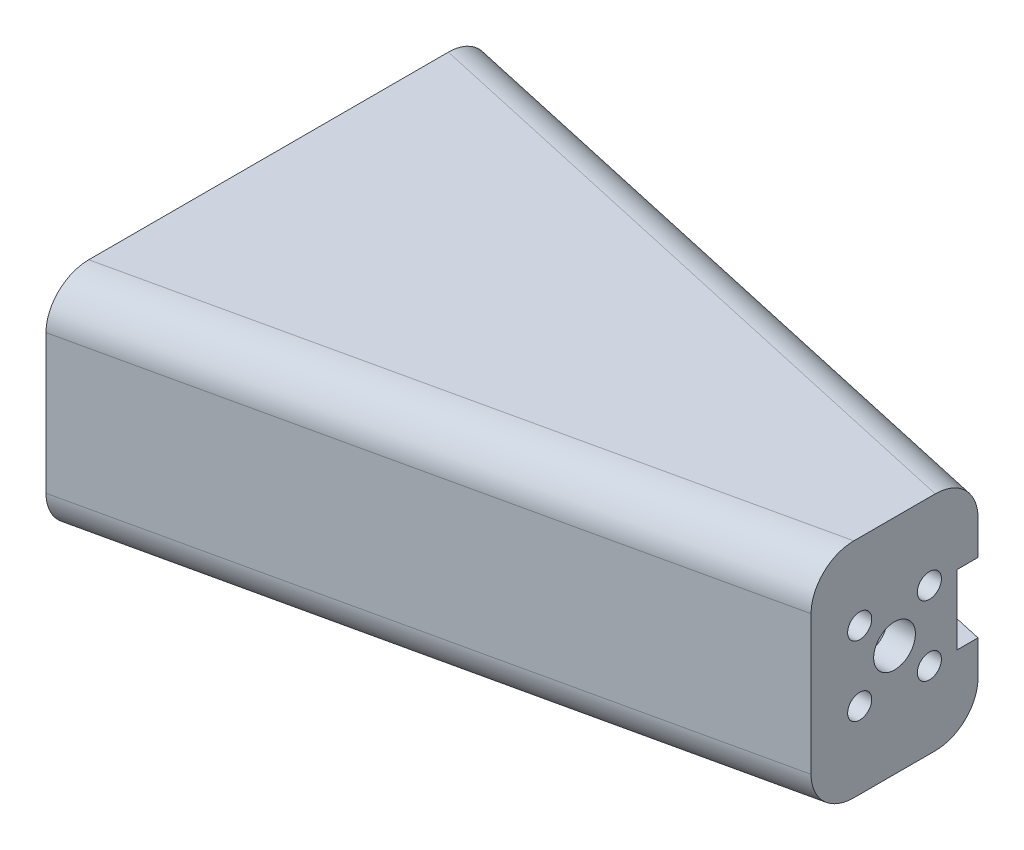
ISO-10303-21;
HEADER;
FILE_DESCRIPTION(('STEP AP214'),'2;1');
FILE_NAME('part.step','',(''),(''),'','','');
FILE_SCHEMA(('AUTOMOTIVE_DESIGN { 1 0 10303 214 1 1 1 1 }'));
ENDSEC;
DATA;
#1=APPLICATION_CONTEXT('core data for automotive mechanical design processes');
#2=APPLICATION_PROTOCOL_DEFINITION('international standard','automotive_design',2000,#1);
#3=PRODUCT_CONTEXT('',#1,'mechanical');
#4=PRODUCT('Part','Part','',(#3));
#5=PRODUCT_RELATED_PRODUCT_CATEGORY('part','',(#4));
#6=PRODUCT_DEFINITION_FORMATION('','',#4);
#7=PRODUCT_DEFINITION_CONTEXT('part definition',#1,'design');
#8=PRODUCT_DEFINITION('design','',#6,#7);
#9=PRODUCT_DEFINITION_SHAPE('','',#8);
#10=(LENGTH_UNIT() NAMED_UNIT(*) SI_UNIT(.MILLI.,.METRE.));
#11=(NAMED_UNIT(*) PLANE_ANGLE_UNIT() SI_UNIT($,.RADIAN.));
#12=(NAMED_UNIT(*) SI_UNIT($,.STERADIAN.) SOLID_ANGLE_UNIT());
#13=UNCERTAINTY_MEASURE_WITH_UNIT(LENGTH_MEASURE(1.E-05),#10,'distance_accuracy_value','');
#14=(GEOMETRIC_REPRESENTATION_CONTEXT(3) GLOBAL_UNCERTAINTY_ASSIGNED_CONTEXT((#13)) GLOBAL_UNIT_ASSIGNED_CONTEXT((#10,
#11,#12)) REPRESENTATION_CONTEXT('',''));
#15=CARTESIAN_POINT('',(0.,0.,0.));
#16=DIRECTION('',(0.,0.,1.));
#17=DIRECTION('',(1.,0.,0.));
#18=AXIS2_PLACEMENT_3D('',#15,#16,#17);
#19=CARTESIAN_POINT('',(57.15,17.78,-7.62000000000001));
#20=DIRECTION('',(-1.,0.,0.));
#21=DIRECTION('',(0.,0.,1.));
#22=AXIS2_PLACEMENT_3D('',#19,#20,#21);
#23=PLANE('',#22);
#24=CARTESIAN_POINT('',(57.15,5.70801948466053,3.18198051533945));
#25=DIRECTION('',(1.,0.,0.));
#26=DIRECTION('',(0.,0.,-1.));
#27=AXIS2_PLACEMENT_3D('',#24,#25,#26);
#28=CIRCLE('',#27,1.1);
#29=CARTESIAN_POINT('',(57.15,5.70801948466053,2.08198051533945));
#30=VERTEX_POINT('',#29);
#31=EDGE_CURVE('E348',#30,#30,#28,.T.);
#32=ORIENTED_EDGE('',*,*,#31,.F.);
#33=EDGE_LOOP('',(#32));
#34=FACE_BOUND('',#33,.T.);
#35=CARTESIAN_POINT('',(57.15,5.70801948466053,-3.18198051533947));
#36=DIRECTION('',(1.,0.,0.));
#37=DIRECTION('',(0.,0.,-1.));
#38=AXIS2_PLACEMENT_3D('',#35,#36,#37);
#39=CIRCLE('',#38,1.1);
#40=CARTESIAN_POINT('',(57.15,5.70801948466053,-4.28198051533947));
#41=VERTEX_POINT('',#40);
#42=EDGE_CURVE('E344',#41,#41,#39,.T.);
#43=ORIENTED_EDGE('',*,*,#42,.F.);
#44=EDGE_LOOP('',(#43));
#45=FACE_BOUND('',#44,.T.);
#46=CARTESIAN_POINT('',(57.15,12.0719805153395,-3.18198051533947));
#47=DIRECTION('',(1.,0.,0.));
#48=DIRECTION('',(0.,0.,-1.));
#49=AXIS2_PLACEMENT_3D('',#46,#47,#48);
#50=CIRCLE('',#49,1.1);
#51=CARTESIAN_POINT('',(57.15,12.0719805153395,-4.28198051533947));
#52=VERTEX_POINT('',#51);
#53=EDGE_CURVE('E340',#52,#52,#50,.T.);
#54=ORIENTED_EDGE('',*,*,#53,.F.);
#55=EDGE_LOOP('',(#54));
#56=FACE_BOUND('',#55,.T.);
#57=CARTESIAN_POINT('',(57.15,12.0719805153395,3.18198051533945));
#58=DIRECTION('',(1.,0.,0.));
#59=DIRECTION('',(0.,0.,-1.));
#60=AXIS2_PLACEMENT_3D('',#57,#58,#59);
#61=CIRCLE('',#60,1.1);
#62=CARTESIAN_POINT('',(57.15,12.0719805153395,2.08198051533945));
#63=VERTEX_POINT('',#62);
#64=EDGE_CURVE('E336',#63,#63,#61,.T.);
#65=ORIENTED_EDGE('',*,*,#64,.F.);
#66=EDGE_LOOP('',(#65));
#67=FACE_BOUND('',#66,.T.);
#68=CARTESIAN_POINT('',(57.15,8.89,0.));
#69=DIRECTION('',(1.,0.,0.));
#70=DIRECTION('',(0.,0.,-1.));
#71=AXIS2_PLACEMENT_3D('',#68,#69,#70);
#72=CIRCLE('',#71,1.905);
#73=CARTESIAN_POINT('',(57.15,8.89,-1.90500000000001));
#74=VERTEX_POINT('',#73);
#75=EDGE_CURVE('E224',#74,#74,#72,.T.);
#76=ORIENTED_EDGE('',*,*,#75,.F.);
#77=EDGE_LOOP('',(#76));
#78=FACE_BOUND('',#77,.T.);
#79=DIRECTION('',(0.,0.,1.));
#80=VECTOR('',#79,1.);
#81=CARTESIAN_POINT('',(57.15,-1.27,-7.62000000000001));
#82=LINE('',#81,#80);
#83=CARTESIAN_POINT('',(57.15,-1.27,-3.71705951307936));
#84=VERTEX_POINT('',#83);
#85=CARTESIAN_POINT('',(57.15,-1.27,3.71705951307933));
#86=VERTEX_POINT('',#85);
#87=EDGE_CURVE('E319',#84,#86,#82,.T.);
#88=ORIENTED_EDGE('',*,*,#87,.F.);
#89=CARTESIAN_POINT('',(57.15,2.54,-3.71705951307936));
#90=DIRECTION('',(-1.,0.,0.));
#91=DIRECTION('',(0.,0.,-1.));
#92=AXIS2_PLACEMENT_3D('',#89,#90,#91);
#93=ELLIPSE('',#92,3.90294048692065,3.81);
#94=CARTESIAN_POINT('',(57.15,2.54,-7.62000000000001));
#95=VERTEX_POINT('',#94);
#96=EDGE_CURVE('E273',#84,#95,#93,.F.);
#97=ORIENTED_EDGE('',*,*,#96,.T.);
#98=DIRECTION('',(0.,-1.,0.));
#99=VECTOR('',#98,1.);
#100=CARTESIAN_POINT('',(57.15,17.78,-7.62000000000001));
#101=LINE('',#100,#99);
#102=CARTESIAN_POINT('',(57.15,5.715,-7.62000000000001));
#103=VERTEX_POINT('',#102);
#104=EDGE_CURVE('E214',#103,#95,#101,.T.);
#105=ORIENTED_EDGE('',*,*,#104,.F.);
#106=DIRECTION('',(0.,0.,-1.));
#107=VECTOR('',#106,1.);
#108=CARTESIAN_POINT('',(57.15,5.715,-5.71500000000001));
#109=LINE('',#108,#107);
#110=CARTESIAN_POINT('',(57.15,5.715,-5.71500000000001));
#111=VERTEX_POINT('',#110);
#112=EDGE_CURVE('E359',#111,#103,#109,.T.);
#113=ORIENTED_EDGE('',*,*,#112,.F.);
#114=DIRECTION('',(0.,-1.,0.));
#115=VECTOR('',#114,1.);
#116=CARTESIAN_POINT('',(57.15,5.715,-5.71500000000001));
#117=LINE('',#116,#115);
#118=CARTESIAN_POINT('',(57.15,12.065,-5.71500000000001));
#119=VERTEX_POINT('',#118);
#120=EDGE_CURVE('E362',#119,#111,#117,.T.);
#121=ORIENTED_EDGE('',*,*,#120,.F.);
#122=DIRECTION('',(0.,0.,1.));
#123=VECTOR('',#122,1.);
#124=CARTESIAN_POINT('',(57.15,12.065,-5.71500000000001));
#125=LINE('',#124,#123);
#126=CARTESIAN_POINT('',(57.15,12.065,-7.62000000000001));
#127=VERTEX_POINT('',#126);
#128=EDGE_CURVE('E352',#127,#119,#125,.T.);
#129=ORIENTED_EDGE('',*,*,#128,.F.);
#130=CARTESIAN_POINT('',(57.15,15.24,-7.62000000000001));
#131=VERTEX_POINT('',#130);
#132=EDGE_CURVE('E215',#131,#127,#101,.T.);
#133=ORIENTED_EDGE('',*,*,#132,.F.);
#134=CARTESIAN_POINT('',(57.15,15.24,-3.71705951307936));
#135=DIRECTION('',(-1.,0.,0.));
#136=DIRECTION('',(0.,0.,1.));
#137=AXIS2_PLACEMENT_3D('',#134,#135,#136);
#138=ELLIPSE('',#137,3.90294048692065,3.81);
#139=CARTESIAN_POINT('',(57.15,19.05,-3.71705951307936));
#140=VERTEX_POINT('',#139);
#141=EDGE_CURVE('E270',#131,#140,#138,.F.);
#142=ORIENTED_EDGE('',*,*,#141,.T.);
#143=DIRECTION('',(0.,0.,-1.));
#144=VECTOR('',#143,1.);
#145=CARTESIAN_POINT('',(57.15,19.05,7.61999999999999));
#146=LINE('',#145,#144);
#147=CARTESIAN_POINT('',(57.15,19.05,3.71705951307933));
#148=VERTEX_POINT('',#147);
#149=EDGE_CURVE('E329',#148,#140,#146,.T.);
#150=ORIENTED_EDGE('',*,*,#149,.F.);
#151=CARTESIAN_POINT('',(57.15,15.24,3.71705951307933));
#152=DIRECTION('',(-1.,0.,0.));
#153=DIRECTION('',(0.,0.,1.));
#154=AXIS2_PLACEMENT_3D('',#151,#152,#153);
#155=ELLIPSE('',#154,3.90294048692066,3.81);
#156=CARTESIAN_POINT('',(57.15,15.24,7.61999999999999));
#157=VERTEX_POINT('',#156);
#158=EDGE_CURVE('E267',#148,#157,#155,.F.);
#159=ORIENTED_EDGE('',*,*,#158,.T.);
#160=DIRECTION('',(0.,-1.,0.));
#161=VECTOR('',#160,1.);
#162=CARTESIAN_POINT('',(57.15,17.78,7.61999999999999));
#163=LINE('',#162,#161);
#164=CARTESIAN_POINT('',(57.15,2.54,7.61999999999999));
#165=VERTEX_POINT('',#164);
#166=EDGE_CURVE('E200',#157,#165,#163,.T.);
#167=ORIENTED_EDGE('',*,*,#166,.T.);
#168=CARTESIAN_POINT('',(57.15,2.54,3.71705951307933));
#169=DIRECTION('',(-1.,0.,0.));
#170=DIRECTION('',(0.,0.,-1.));
#171=AXIS2_PLACEMENT_3D('',#168,#169,#170);
#172=ELLIPSE('',#171,3.90294048692066,3.81);
#173=EDGE_CURVE('E264',#165,#86,#172,.F.);
#174=ORIENTED_EDGE('',*,*,#173,.T.);
#175=EDGE_LOOP('',(#88,#97,#105,#113,#121,#129,#133,#142,#150,#159,#167,#174));
#176=FACE_BOUND('',#175,.T.);
#177=ADVANCED_FACE('F43',(#34,#45,#56,#67,#78,#176),#23,.F.);
#178=CARTESIAN_POINT('',(0.,17.78,-20.32));
#179=DIRECTION('',(-0.216930457818656,0.,0.976187060183953));
#180=DIRECTION('',(0.976187060183953,0.,0.216930457818656));
#181=AXIS2_PLACEMENT_3D('',#178,#179,#180);
#182=PLANE('',#181);
#183=ORIENTED_EDGE('',*,*,#104,.T.);
#184=DIRECTION('',(0.976187060183953,0.,0.216930457818656));
#185=VECTOR('',#184,1.);
#186=CARTESIAN_POINT('',(0.,2.54,-20.32));
#187=LINE('',#186,#185);
#188=CARTESIAN_POINT('',(0.,2.54,-20.32));
#189=VERTEX_POINT('',#188);
#190=EDGE_CURVE('E279',#95,#189,#187,.F.);
#191=ORIENTED_EDGE('',*,*,#190,.T.);
#192=DIRECTION('',(0.,-1.,0.));
#193=VECTOR('',#192,1.);
#194=CARTESIAN_POINT('',(0.,17.78,-20.32));
#195=LINE('',#194,#193);
#196=CARTESIAN_POINT('',(0.,15.24,-20.32));
#197=VERTEX_POINT('',#196);
#198=EDGE_CURVE('E210',#197,#189,#195,.T.);
#199=ORIENTED_EDGE('',*,*,#198,.F.);
#200=DIRECTION('',(-0.976187060183953,0.,-0.216930457818656));
#201=VECTOR('',#200,1.);
#202=CARTESIAN_POINT('',(57.15,15.24,-7.62000000000001));
#203=LINE('',#202,#201);
#204=EDGE_CURVE('E276',#197,#131,#203,.F.);
#205=ORIENTED_EDGE('',*,*,#204,.T.);
#206=ORIENTED_EDGE('',*,*,#132,.T.);
#207=DIRECTION('',(-0.976187060183953,0.,-0.216930457818656));
#208=VECTOR('',#207,1.);
#209=CARTESIAN_POINT('',(0.,12.065,-20.32));
#210=LINE('',#209,#208);
#211=CARTESIAN_POINT('',(49.53,12.065,-9.31333333333334));
#212=VERTEX_POINT('',#211);
#213=EDGE_CURVE('E380',#127,#212,#210,.T.);
#214=ORIENTED_EDGE('',*,*,#213,.T.);
#215=DIRECTION('',(0.,-1.,0.));
#216=VECTOR('',#215,1.);
#217=CARTESIAN_POINT('',(49.53,17.78,-9.31333333333334));
#218=LINE('',#217,#216);
#219=CARTESIAN_POINT('',(49.53,5.715,-9.31333333333334));
#220=VERTEX_POINT('',#219);
#221=EDGE_CURVE('E240',#212,#220,#218,.T.);
#222=ORIENTED_EDGE('',*,*,#221,.T.);
#223=DIRECTION('',(0.976187060183953,0.,0.216930457818656));
#224=VECTOR('',#223,1.);
#225=CARTESIAN_POINT('',(0.,5.715,-20.32));
#226=LINE('',#225,#224);
#227=EDGE_CURVE('E384',#220,#103,#226,.T.);
#228=ORIENTED_EDGE('',*,*,#227,.T.);
#229=EDGE_LOOP('',(#183,#191,#199,#205,#206,#214,#222,#228));
#230=FACE_BOUND('',#229,.T.);
#231=ADVANCED_FACE('F423',(#230),#182,.F.);
#232=CARTESIAN_POINT('',(0.,17.78,-17.7180396753862));
#233=DIRECTION('',(0.216930457818656,0.,-0.976187060183953));
#234=DIRECTION('',(-0.976187060183953,0.,-0.216930457818656));
#235=AXIS2_PLACEMENT_3D('',#232,#233,#234);
#236=PLANE('',#235);
#237=DIRECTION('',(0.,-1.,0.));
#238=VECTOR('',#237,1.);
#239=CARTESIAN_POINT('',(54.013678539238,17.78,-5.71500000000001));
#240=LINE('',#239,#238);
#241=CARTESIAN_POINT('',(54.0136785392381,12.065,-5.715));
#242=VERTEX_POINT('',#241);
#243=CARTESIAN_POINT('',(54.013678539238,5.715,-5.71500000000001));
#244=VERTEX_POINT('',#243);
#245=EDGE_CURVE('E248',#242,#244,#240,.T.);
#246=ORIENTED_EDGE('',*,*,#245,.T.);
#247=DIRECTION('',(-0.976187060183953,0.,-0.216930457818656));
#248=VECTOR('',#247,1.);
#249=CARTESIAN_POINT('',(0.,5.715,-17.7180396753862));
#250=LINE('',#249,#248);
#251=CARTESIAN_POINT('',(49.53,5.715,-6.71137300871956));
#252=VERTEX_POINT('',#251);
#253=EDGE_CURVE('E252',#244,#252,#250,.T.);
#254=ORIENTED_EDGE('',*,*,#253,.T.);
#255=DIRECTION('',(0.,1.,0.));
#256=VECTOR('',#255,1.);
#257=CARTESIAN_POINT('',(49.53,17.78,-6.71137300871956));
#258=LINE('',#257,#256);
#259=CARTESIAN_POINT('',(49.53,12.065,-6.71137300871956));
#260=VERTEX_POINT('',#259);
#261=EDGE_CURVE('E218',#252,#260,#258,.T.);
#262=ORIENTED_EDGE('',*,*,#261,.T.);
#263=DIRECTION('',(0.976187060183953,0.,0.216930457818656));
#264=VECTOR('',#263,1.);
#265=CARTESIAN_POINT('',(0.,12.065,-17.7180396753862));
#266=LINE('',#265,#264);
#267=EDGE_CURVE('E244',#260,#242,#266,.T.);
#268=ORIENTED_EDGE('',*,*,#267,.T.);
#269=EDGE_LOOP('',(#246,#254,#262,#268));
#270=FACE_BOUND('',#269,.T.);
#271=DIRECTION('',(0.976187060183953,0.,0.216930457818656));
#272=VECTOR('',#271,1.);
#273=CARTESIAN_POINT('',(0.,0.,-17.7180396753862));
#274=LINE('',#273,#272);
#275=CARTESIAN_POINT('',(0.,0.,-17.7180396753862));
#276=VERTEX_POINT('',#275);
#277=CARTESIAN_POINT('',(54.61,0.,-5.58248411983068));
#278=VERTEX_POINT('',#277);
#279=EDGE_CURVE('E170',#276,#278,#274,.T.);
#280=ORIENTED_EDGE('',*,*,#279,.T.);
#281=DIRECTION('',(0.,-1.,0.));
#282=VECTOR('',#281,1.);
#283=CARTESIAN_POINT('',(54.61,17.78,-5.58248411983068));
#284=LINE('',#283,#282);
#285=CARTESIAN_POINT('',(54.61,17.78,-5.58248411983068));
#286=VERTEX_POINT('',#285);
#287=EDGE_CURVE('E197',#286,#278,#284,.T.);
#288=ORIENTED_EDGE('',*,*,#287,.F.);
#289=DIRECTION('',(0.976187060183953,0.,0.216930457818656));
#290=VECTOR('',#289,1.);
#291=CARTESIAN_POINT('',(0.,17.78,-17.7180396753862));
#292=LINE('',#291,#290);
#293=CARTESIAN_POINT('',(0.,17.78,-17.7180396753862));
#294=VERTEX_POINT('',#293);
#295=EDGE_CURVE('E185',#294,#286,#292,.T.);
#296=ORIENTED_EDGE('',*,*,#295,.F.);
#297=DIRECTION('',(0.,-1.,0.));
#298=VECTOR('',#297,1.);
#299=CARTESIAN_POINT('',(0.,17.78,-17.7180396753862));
#300=LINE('',#299,#298);
#301=EDGE_CURVE('E207',#294,#276,#300,.T.);
#302=ORIENTED_EDGE('',*,*,#301,.T.);
#303=EDGE_LOOP('',(#280,#288,#296,#302));
#304=FACE_BOUND('',#303,.T.);
#305=ADVANCED_FACE('F404',(#270,#304),#236,.F.);
#306=CARTESIAN_POINT('',(54.61,17.78,-5.58248411983068));
#307=DIRECTION('',(1.,0.,0.));
#308=DIRECTION('',(0.,0.,-1.));
#309=AXIS2_PLACEMENT_3D('',#306,#307,#308);
#310=PLANE('',#309);
#311=CARTESIAN_POINT('',(54.61,5.70801948466053,3.18198051533945));
#312=DIRECTION('',(1.,0.,0.));
#313=DIRECTION('',(0.,0.,-1.));
#314=AXIS2_PLACEMENT_3D('',#311,#312,#313);
#315=CIRCLE('',#314,1.1);
#316=CARTESIAN_POINT('',(54.61,5.70801948466053,2.08198051533945));
#317=VERTEX_POINT('',#316);
#318=EDGE_CURVE('E236',#317,#317,#315,.T.);
#319=ORIENTED_EDGE('',*,*,#318,.T.);
#320=EDGE_LOOP('',(#319));
#321=FACE_BOUND('',#320,.T.);
#322=CARTESIAN_POINT('',(54.61,5.70801948466053,-3.18198051533947));
#323=DIRECTION('',(1.,0.,0.));
#324=DIRECTION('',(0.,0.,-1.));
#325=AXIS2_PLACEMENT_3D('',#322,#323,#324);
#326=CIRCLE('',#325,1.1);
#327=CARTESIAN_POINT('',(54.61,5.70801948466053,-4.28198051533947));
#328=VERTEX_POINT('',#327);
#329=EDGE_CURVE('E232',#328,#328,#326,.T.);
#330=ORIENTED_EDGE('',*,*,#329,.T.);
#331=EDGE_LOOP('',(#330));
#332=FACE_BOUND('',#331,.T.);
#333=CARTESIAN_POINT('',(54.61,12.0719805153395,-3.18198051533947));
#334=DIRECTION('',(1.,0.,0.));
#335=DIRECTION('',(0.,0.,-1.));
#336=AXIS2_PLACEMENT_3D('',#333,#334,#335);
#337=CIRCLE('',#336,1.1);
#338=CARTESIAN_POINT('',(54.61,12.0719805153395,-4.28198051533947));
#339=VERTEX_POINT('',#338);
#340=EDGE_CURVE('E228',#339,#339,#337,.T.);
#341=ORIENTED_EDGE('',*,*,#340,.T.);
#342=EDGE_LOOP('',(#341));
#343=FACE_BOUND('',#342,.T.);
#344=CARTESIAN_POINT('',(54.61,12.0719805153395,3.18198051533945));
#345=DIRECTION('',(1.,0.,0.));
#346=DIRECTION('',(0.,0.,-1.));
#347=AXIS2_PLACEMENT_3D('',#344,#345,#346);
#348=CIRCLE('',#347,1.1);
#349=CARTESIAN_POINT('',(54.61,12.0719805153395,2.08198051533945));
#350=VERTEX_POINT('',#349);
#351=EDGE_CURVE('E223',#350,#350,#348,.T.);
#352=ORIENTED_EDGE('',*,*,#351,.T.);
#353=EDGE_LOOP('',(#352));
#354=FACE_BOUND('',#353,.T.);
#355=CARTESIAN_POINT('',(54.61,8.89,0.));
#356=DIRECTION('',(1.,0.,0.));
#357=DIRECTION('',(0.,0.,-1.));
#358=AXIS2_PLACEMENT_3D('',#355,#356,#357);
#359=CIRCLE('',#358,1.905);
#360=CARTESIAN_POINT('',(54.61,8.89,-1.90500000000001));
#361=VERTEX_POINT('',#360);
#362=EDGE_CURVE('E219',#361,#361,#359,.T.);
#363=ORIENTED_EDGE('',*,*,#362,.T.);
#364=EDGE_LOOP('',(#363));
#365=FACE_BOUND('',#364,.T.);
#366=DIRECTION('',(0.,0.,1.));
#367=VECTOR('',#366,1.);
#368=CARTESIAN_POINT('',(54.61,0.,-5.58248411983068));
#369=LINE('',#368,#367);
#370=CARTESIAN_POINT('',(54.61,0.,5.58248411983066));
#371=VERTEX_POINT('',#370);
#372=EDGE_CURVE('E186',#278,#371,#369,.T.);
#373=ORIENTED_EDGE('',*,*,#372,.T.);
#374=DIRECTION('',(0.,-1.,0.));
#375=VECTOR('',#374,1.);
#376=CARTESIAN_POINT('',(54.61,17.78,5.58248411983066));
#377=LINE('',#376,#375);
#378=CARTESIAN_POINT('',(54.61,17.78,5.58248411983066));
#379=VERTEX_POINT('',#378);
#380=EDGE_CURVE('E183',#379,#371,#377,.T.);
#381=ORIENTED_EDGE('',*,*,#380,.F.);
#382=DIRECTION('',(0.,0.,1.));
#383=VECTOR('',#382,1.);
#384=CARTESIAN_POINT('',(54.61,17.78,-5.58248411983068));
#385=LINE('',#384,#383);
#386=EDGE_CURVE('E391',#286,#379,#385,.T.);
#387=ORIENTED_EDGE('',*,*,#386,.F.);
#388=ORIENTED_EDGE('',*,*,#287,.T.);
#389=EDGE_LOOP('',(#373,#381,#387,#388));
#390=FACE_BOUND('',#389,.T.);
#391=ADVANCED_FACE('F401',(#321,#332,#343,#354,#365,#390),#310,.F.);
#392=CARTESIAN_POINT('',(54.61,17.78,5.58248411983066));
#393=DIRECTION('',(0.216930457818656,0.,0.976187060183953));
#394=DIRECTION('',(0.976187060183953,0.,-0.216930457818656));
#395=AXIS2_PLACEMENT_3D('',#392,#393,#394);
#396=PLANE('',#395);
#397=DIRECTION('',(-0.976187060183953,0.,0.216930457818656));
#398=VECTOR('',#397,1.);
#399=CARTESIAN_POINT('',(54.61,0.,5.58248411983066));
#400=LINE('',#399,#398);
#401=CARTESIAN_POINT('',(0.,0.,17.7180396753862));
#402=VERTEX_POINT('',#401);
#403=EDGE_CURVE('E167',#371,#402,#400,.T.);
#404=ORIENTED_EDGE('',*,*,#403,.T.);
#405=DIRECTION('',(0.,-1.,0.));
#406=VECTOR('',#405,1.);
#407=CARTESIAN_POINT('',(0.,17.78,17.7180396753862));
#408=LINE('',#407,#406);
#409=CARTESIAN_POINT('',(0.,17.78,17.7180396753862));
#410=VERTEX_POINT('',#409);
#411=EDGE_CURVE('E181',#410,#402,#408,.T.);
#412=ORIENTED_EDGE('',*,*,#411,.F.);
#413=DIRECTION('',(-0.976187060183953,0.,0.216930457818656));
#414=VECTOR('',#413,1.);
#415=CARTESIAN_POINT('',(54.61,17.78,5.58248411983066));
#416=LINE('',#415,#414);
#417=EDGE_CURVE('E312',#379,#410,#416,.T.);
#418=ORIENTED_EDGE('',*,*,#417,.F.);
#419=ORIENTED_EDGE('',*,*,#380,.T.);
#420=EDGE_LOOP('',(#404,#412,#418,#419));
#421=FACE_BOUND('',#420,.T.);
#422=ADVANCED_FACE('F179',(#421),#396,.F.);
#423=CARTESIAN_POINT('',(0.,17.78,17.7180396753862));
#424=DIRECTION('',(1.,0.,0.));
#425=DIRECTION('',(0.,0.,-1.));
#426=AXIS2_PLACEMENT_3D('',#423,#424,#425);
#427=PLANE('',#426);
#428=ORIENTED_EDGE('',*,*,#198,.T.);
#429=CARTESIAN_POINT('',(0.,2.54,-16.4170595130793));
#430=DIRECTION('',(1.,0.,0.));
#431=DIRECTION('',(0.,0.,-1.));
#432=AXIS2_PLACEMENT_3D('',#429,#430,#431);
#433=ELLIPSE('',#432,3.90294048692065,3.81);
#434=CARTESIAN_POINT('',(0.,-1.27,-16.4170595130793));
#435=VERTEX_POINT('',#434);
#436=EDGE_CURVE('E289',#189,#435,#433,.F.);
#437=ORIENTED_EDGE('',*,*,#436,.T.);
#438=DIRECTION('',(0.,0.,-1.));
#439=VECTOR('',#438,1.);
#440=CARTESIAN_POINT('',(0.,-1.27,20.32));
#441=LINE('',#440,#439);
#442=CARTESIAN_POINT('',(0.,-1.27,16.4170595130794));
#443=VERTEX_POINT('',#442);
#444=EDGE_CURVE('E175',#443,#435,#441,.T.);
#445=ORIENTED_EDGE('',*,*,#444,.F.);
#446=CARTESIAN_POINT('',(0.,2.54,16.4170595130793));
#447=DIRECTION('',(1.,0.,0.));
#448=DIRECTION('',(0.,0.,-1.));
#449=AXIS2_PLACEMENT_3D('',#446,#447,#448);
#450=ELLIPSE('',#449,3.90294048692066,3.81);
#451=CARTESIAN_POINT('',(0.,2.54,20.32));
#452=VERTEX_POINT('',#451);
#453=EDGE_CURVE('E282',#443,#452,#450,.F.);
#454=ORIENTED_EDGE('',*,*,#453,.T.);
#455=DIRECTION('',(0.,-1.,0.));
#456=VECTOR('',#455,1.);
#457=CARTESIAN_POINT('',(0.,17.78,20.32));
#458=LINE('',#457,#456);
#459=CARTESIAN_POINT('',(0.,15.24,20.32));
#460=VERTEX_POINT('',#459);
#461=EDGE_CURVE('E193',#460,#452,#458,.T.);
#462=ORIENTED_EDGE('',*,*,#461,.F.);
#463=CARTESIAN_POINT('',(0.,15.24,16.4170595130793));
#464=DIRECTION('',(1.,0.,0.));
#465=DIRECTION('',(0.,0.,1.));
#466=AXIS2_PLACEMENT_3D('',#463,#464,#465);
#467=ELLIPSE('',#466,3.90294048692066,3.81);
#468=CARTESIAN_POINT('',(0.,19.05,16.4170595130793));
#469=VERTEX_POINT('',#468);
#470=EDGE_CURVE('E59',#460,#469,#467,.F.);
#471=ORIENTED_EDGE('',*,*,#470,.T.);
#472=DIRECTION('',(0.,0.,1.));
#473=VECTOR('',#472,1.);
#474=CARTESIAN_POINT('',(0.,19.05,-20.32));
#475=LINE('',#474,#473);
#476=CARTESIAN_POINT('',(0.,19.05,-16.4170595130794));
#477=VERTEX_POINT('',#476);
#478=EDGE_CURVE('E326',#477,#469,#475,.T.);
#479=ORIENTED_EDGE('',*,*,#478,.F.);
#480=CARTESIAN_POINT('',(0.,15.24,-16.4170595130793));
#481=DIRECTION('',(1.,0.,0.));
#482=DIRECTION('',(0.,0.,1.));
#483=AXIS2_PLACEMENT_3D('',#480,#481,#482);
#484=ELLIPSE('',#483,3.90294048692065,3.81);
#485=EDGE_CURVE('E67',#477,#197,#484,.F.);
#486=ORIENTED_EDGE('',*,*,#485,.T.);
#487=EDGE_LOOP('',(#428,#437,#445,#454,#462,#471,#479,#486));
#488=FACE_BOUND('',#487,.T.);
#489=ORIENTED_EDGE('',*,*,#411,.T.);
#490=DIRECTION('',(0.,0.,-1.));
#491=VECTOR('',#490,1.);
#492=CARTESIAN_POINT('',(0.,0.,20.32));
#493=LINE('',#492,#491);
#494=EDGE_CURVE('E164',#402,#276,#493,.T.);
#495=ORIENTED_EDGE('',*,*,#494,.T.);
#496=ORIENTED_EDGE('',*,*,#301,.F.);
#497=DIRECTION('',(0.,0.,1.));
#498=VECTOR('',#497,1.);
#499=CARTESIAN_POINT('',(0.,17.78,-20.32));
#500=LINE('',#499,#498);
#501=EDGE_CURVE('E191',#294,#410,#500,.T.);
#502=ORIENTED_EDGE('',*,*,#501,.T.);
#503=EDGE_LOOP('',(#489,#495,#496,#502));
#504=FACE_BOUND('',#503,.T.);
#505=ADVANCED_FACE('F189',(#488,#504),#427,.F.);
#506=CARTESIAN_POINT('',(0.,17.78,20.32));
#507=DIRECTION('',(-0.216930457818656,0.,-0.976187060183953));
#508=DIRECTION('',(-0.976187060183953,0.,0.216930457818656));
#509=AXIS2_PLACEMENT_3D('',#506,#507,#508);
#510=PLANE('',#509);
#511=ORIENTED_EDGE('',*,*,#166,.F.);
#512=DIRECTION('',(0.976187060183953,0.,-0.216930457818656));
#513=VECTOR('',#512,1.);
#514=CARTESIAN_POINT('',(0.,15.24,20.32));
#515=LINE('',#514,#513);
#516=EDGE_CURVE('E11',#157,#460,#515,.F.);
#517=ORIENTED_EDGE('',*,*,#516,.T.);
#518=ORIENTED_EDGE('',*,*,#461,.T.);
#519=DIRECTION('',(-0.976187060183953,0.,0.216930457818656));
#520=VECTOR('',#519,1.);
#521=CARTESIAN_POINT('',(57.15,2.54,7.61999999999999));
#522=LINE('',#521,#520);
#523=EDGE_CURVE('E52',#452,#165,#522,.F.);
#524=ORIENTED_EDGE('',*,*,#523,.T.);
#525=EDGE_LOOP('',(#511,#517,#518,#524));
#526=FACE_BOUND('',#525,.T.);
#527=ADVANCED_FACE('F303',(#526),#510,.F.);
#528=CARTESIAN_POINT('',(49.53,8.89,0.));
#529=DIRECTION('',(1.,0.,0.));
#530=DIRECTION('',(0.,0.,-1.));
#531=AXIS2_PLACEMENT_3D('',#528,#529,#530);
#532=CYLINDRICAL_SURFACE('',#531,1.905);
#533=ORIENTED_EDGE('',*,*,#75,.T.);
#534=EDGE_LOOP('',(#533));
#535=FACE_BOUND('',#534,.T.);
#536=ORIENTED_EDGE('',*,*,#362,.F.);
#537=EDGE_LOOP('',(#536));
#538=FACE_BOUND('',#537,.T.);
#539=ADVANCED_FACE('F482',(#535,#538),#532,.F.);
#540=CARTESIAN_POINT('',(49.53,12.0719805153395,3.18198051533945));
#541=DIRECTION('',(1.,0.,0.));
#542=DIRECTION('',(0.,0.,-1.));
#543=AXIS2_PLACEMENT_3D('',#540,#541,#542);
#544=CYLINDRICAL_SURFACE('',#543,1.1);
#545=ORIENTED_EDGE('',*,*,#64,.T.);
#546=EDGE_LOOP('',(#545));
#547=FACE_BOUND('',#546,.T.);
#548=ORIENTED_EDGE('',*,*,#351,.F.);
#549=EDGE_LOOP('',(#548));
#550=FACE_BOUND('',#549,.T.);
#551=ADVANCED_FACE('F485',(#547,#550),#544,.F.);
#552=CARTESIAN_POINT('',(49.53,12.0719805153395,-3.18198051533947));
#553=DIRECTION('',(1.,0.,0.));
#554=DIRECTION('',(0.,0.,-1.));
#555=AXIS2_PLACEMENT_3D('',#552,#553,#554);
#556=CYLINDRICAL_SURFACE('',#555,1.1);
#557=ORIENTED_EDGE('',*,*,#53,.T.);
#558=EDGE_LOOP('',(#557));
#559=FACE_BOUND('',#558,.T.);
#560=ORIENTED_EDGE('',*,*,#340,.F.);
#561=EDGE_LOOP('',(#560));
#562=FACE_BOUND('',#561,.T.);
#563=ADVANCED_FACE('F528',(#559,#562),#556,.F.);
#564=CARTESIAN_POINT('',(49.53,5.70801948466053,-3.18198051533947));
#565=DIRECTION('',(1.,0.,0.));
#566=DIRECTION('',(0.,0.,-1.));
#567=AXIS2_PLACEMENT_3D('',#564,#565,#566);
#568=CYLINDRICAL_SURFACE('',#567,1.1);
#569=ORIENTED_EDGE('',*,*,#42,.T.);
#570=EDGE_LOOP('',(#569));
#571=FACE_BOUND('',#570,.T.);
#572=ORIENTED_EDGE('',*,*,#329,.F.);
#573=EDGE_LOOP('',(#572));
#574=FACE_BOUND('',#573,.T.);
#575=ADVANCED_FACE('F535',(#571,#574),#568,.F.);
#576=CARTESIAN_POINT('',(49.53,5.70801948466053,3.18198051533945));
#577=DIRECTION('',(1.,0.,0.));
#578=DIRECTION('',(0.,0.,-1.));
#579=AXIS2_PLACEMENT_3D('',#576,#577,#578);
#580=CYLINDRICAL_SURFACE('',#579,1.1);
#581=ORIENTED_EDGE('',*,*,#31,.T.);
#582=EDGE_LOOP('',(#581));
#583=FACE_BOUND('',#582,.T.);
#584=ORIENTED_EDGE('',*,*,#318,.F.);
#585=EDGE_LOOP('',(#584));
#586=FACE_BOUND('',#585,.T.);
#587=ADVANCED_FACE('F478',(#583,#586),#580,.F.);
#588=CARTESIAN_POINT('',(49.53,5.715,-5.71500000000001));
#589=DIRECTION('',(0.,-1.,0.));
#590=DIRECTION('',(0.,0.,-1.));
#591=AXIS2_PLACEMENT_3D('',#588,#589,#590);
#592=PLANE('',#591);
#593=DIRECTION('',(0.,0.,-1.));
#594=VECTOR('',#593,1.);
#595=CARTESIAN_POINT('',(49.53,5.715,-5.71500000000001));
#596=LINE('',#595,#594);
#597=EDGE_CURVE('E356',#252,#220,#596,.T.);
#598=ORIENTED_EDGE('',*,*,#597,.F.);
#599=ORIENTED_EDGE('',*,*,#253,.F.);
#600=DIRECTION('',(1.,0.,0.));
#601=VECTOR('',#600,1.);
#602=CARTESIAN_POINT('',(49.53,5.715,-5.71500000000001));
#603=LINE('',#602,#601);
#604=EDGE_CURVE('E333',#244,#111,#603,.T.);
#605=ORIENTED_EDGE('',*,*,#604,.T.);
#606=ORIENTED_EDGE('',*,*,#112,.T.);
#607=ORIENTED_EDGE('',*,*,#227,.F.);
#608=EDGE_LOOP('',(#598,#599,#605,#606,#607));
#609=FACE_BOUND('',#608,.T.);
#610=ADVANCED_FACE('F461',(#609),#592,.F.);
#611=CARTESIAN_POINT('',(49.53,5.715,-5.71500000000001));
#612=DIRECTION('',(0.,0.,1.));
#613=DIRECTION('',(1.,0.,0.));
#614=AXIS2_PLACEMENT_3D('',#611,#612,#613);
#615=PLANE('',#614);
#616=DIRECTION('',(1.,0.,0.));
#617=VECTOR('',#616,1.);
#618=CARTESIAN_POINT('',(49.53,12.065,-5.71500000000001));
#619=LINE('',#618,#617);
#620=EDGE_CURVE('E353',#242,#119,#619,.T.);
#621=ORIENTED_EDGE('',*,*,#620,.T.);
#622=ORIENTED_EDGE('',*,*,#120,.T.);
#623=ORIENTED_EDGE('',*,*,#604,.F.);
#624=ORIENTED_EDGE('',*,*,#245,.F.);
#625=EDGE_LOOP('',(#621,#622,#623,#624));
#626=FACE_BOUND('',#625,.T.);
#627=ADVANCED_FACE('F470',(#626),#615,.F.);
#628=CARTESIAN_POINT('',(49.53,12.065,-5.71500000000001));
#629=DIRECTION('',(0.,1.,0.));
#630=DIRECTION('',(0.,0.,1.));
#631=AXIS2_PLACEMENT_3D('',#628,#629,#630);
#632=PLANE('',#631);
#633=ORIENTED_EDGE('',*,*,#128,.T.);
#634=ORIENTED_EDGE('',*,*,#620,.F.);
#635=ORIENTED_EDGE('',*,*,#267,.F.);
#636=DIRECTION('',(0.,0.,1.));
#637=VECTOR('',#636,1.);
#638=CARTESIAN_POINT('',(49.53,12.065,-5.71500000000001));
#639=LINE('',#638,#637);
#640=EDGE_CURVE('E363',#212,#260,#639,.T.);
#641=ORIENTED_EDGE('',*,*,#640,.F.);
#642=ORIENTED_EDGE('',*,*,#213,.F.);
#643=EDGE_LOOP('',(#633,#634,#635,#641,#642));
#644=FACE_BOUND('',#643,.T.);
#645=ADVANCED_FACE('F418',(#644),#632,.F.);
#646=CARTESIAN_POINT('',(49.53,0.,0.));
#647=DIRECTION('',(-1.,0.,0.));
#648=DIRECTION('',(0.,0.,1.));
#649=AXIS2_PLACEMENT_3D('',#646,#647,#648);
#650=PLANE('',#649);
#651=ORIENTED_EDGE('',*,*,#640,.T.);
#652=ORIENTED_EDGE('',*,*,#261,.F.);
#653=ORIENTED_EDGE('',*,*,#597,.T.);
#654=ORIENTED_EDGE('',*,*,#221,.F.);
#655=EDGE_LOOP('',(#651,#652,#653,#654));
#656=FACE_BOUND('',#655,.T.);
#657=ADVANCED_FACE('F410',(#656),#650,.F.);
#658=CARTESIAN_POINT('',(0.,17.78,0.));
#659=DIRECTION('',(0.,1.,0.));
#660=DIRECTION('',(0.,0.,1.));
#661=AXIS2_PLACEMENT_3D('',#658,#659,#660);
#662=PLANE('',#661);
#663=ORIENTED_EDGE('',*,*,#501,.F.);
#664=ORIENTED_EDGE('',*,*,#295,.T.);
#665=ORIENTED_EDGE('',*,*,#386,.T.);
#666=ORIENTED_EDGE('',*,*,#417,.T.);
#667=EDGE_LOOP('',(#663,#664,#665,#666));
#668=FACE_BOUND('',#667,.T.);
#669=ADVANCED_FACE('F407',(#668),#662,.F.);
#670=CARTESIAN_POINT('',(0.,19.05,0.));
#671=DIRECTION('',(0.,1.,0.));
#672=DIRECTION('',(0.,0.,1.));
#673=AXIS2_PLACEMENT_3D('',#670,#671,#672);
#674=PLANE('',#673);
#675=ORIENTED_EDGE('',*,*,#149,.T.);
#676=DIRECTION('',(-0.976187060183953,0.,-0.216930457818656));
#677=VECTOR('',#676,1.);
#678=CARTESIAN_POINT('',(-0.826505044289087,19.05,-16.6007273006991));
#679=LINE('',#678,#677);
#680=EDGE_CURVE('E296',#140,#477,#679,.T.);
#681=ORIENTED_EDGE('',*,*,#680,.T.);
#682=ORIENTED_EDGE('',*,*,#478,.T.);
#683=DIRECTION('',(0.976187060183953,0.,-0.216930457818656));
#684=VECTOR('',#683,1.);
#685=CARTESIAN_POINT('',(56.3234949557109,19.05,3.90072730069913));
#686=LINE('',#685,#684);
#687=EDGE_CURVE('E292',#469,#148,#686,.T.);
#688=ORIENTED_EDGE('',*,*,#687,.T.);
#689=EDGE_LOOP('',(#675,#681,#682,#688));
#690=FACE_BOUND('',#689,.T.);
#691=ADVANCED_FACE('F409',(#690),#674,.T.);
#692=CARTESIAN_POINT('',(0.,-1.27,0.));
#693=DIRECTION('',(0.,-1.,0.));
#694=DIRECTION('',(0.,0.,-1.));
#695=AXIS2_PLACEMENT_3D('',#692,#693,#694);
#696=PLANE('',#695);
#697=ORIENTED_EDGE('',*,*,#444,.T.);
#698=DIRECTION('',(0.976187060183953,0.,0.216930457818656));
#699=VECTOR('',#698,1.);
#700=CARTESIAN_POINT('',(56.3234949557109,-1.27,-3.90072730069915));
#701=LINE('',#700,#699);
#702=EDGE_CURVE('E260',#435,#84,#701,.T.);
#703=ORIENTED_EDGE('',*,*,#702,.T.);
#704=ORIENTED_EDGE('',*,*,#87,.T.);
#705=DIRECTION('',(-0.976187060183953,0.,0.216930457818656));
#706=VECTOR('',#705,1.);
#707=CARTESIAN_POINT('',(-0.82650504428908,-1.27,16.6007273006991));
#708=LINE('',#707,#706);
#709=EDGE_CURVE('E256',#86,#443,#708,.T.);
#710=ORIENTED_EDGE('',*,*,#709,.T.);
#711=EDGE_LOOP('',(#697,#703,#704,#710));
#712=FACE_BOUND('',#711,.T.);
#713=ADVANCED_FACE('F317',(#712),#696,.T.);
#714=CARTESIAN_POINT('',(0.,0.,0.));
#715=DIRECTION('',(0.,-1.,0.));
#716=DIRECTION('',(0.,0.,-1.));
#717=AXIS2_PLACEMENT_3D('',#714,#715,#716);
#718=PLANE('',#717);
#719=ORIENTED_EDGE('',*,*,#403,.F.);
#720=ORIENTED_EDGE('',*,*,#372,.F.);
#721=ORIENTED_EDGE('',*,*,#279,.F.);
#722=ORIENTED_EDGE('',*,*,#494,.F.);
#723=EDGE_LOOP('',(#719,#720,#721,#722));
#724=FACE_BOUND('',#723,.T.);
#725=ADVANCED_FACE('F166',(#724),#718,.F.);
#726=CARTESIAN_POINT('',(3.47655377924033,2.54,-15.6444920065815));
#727=DIRECTION('',(-0.976187060183953,0.,-0.216930457818656));
#728=DIRECTION('',(-0.216930457818656,0.,0.976187060183953));
#729=AXIS2_PLACEMENT_3D('',#726,#727,#728);
#730=CYLINDRICAL_SURFACE('',#729,3.81);
#731=ORIENTED_EDGE('',*,*,#436,.F.);
#732=ORIENTED_EDGE('',*,*,#190,.F.);
#733=ORIENTED_EDGE('',*,*,#96,.F.);
#734=ORIENTED_EDGE('',*,*,#702,.F.);
#735=EDGE_LOOP('',(#731,#732,#733,#734));
#736=FACE_BOUND('',#735,.T.);
#737=ADVANCED_FACE('F435',(#736),#730,.T.);
#738=CARTESIAN_POINT('',(3.47655377924033,15.24,-15.6444920065815));
#739=DIRECTION('',(0.976187060183953,0.,0.216930457818656));
#740=DIRECTION('',(0.216930457818656,0.,-0.976187060183953));
#741=AXIS2_PLACEMENT_3D('',#738,#739,#740);
#742=CYLINDRICAL_SURFACE('',#741,3.81);
#743=ORIENTED_EDGE('',*,*,#141,.F.);
#744=ORIENTED_EDGE('',*,*,#204,.F.);
#745=ORIENTED_EDGE('',*,*,#485,.F.);
#746=ORIENTED_EDGE('',*,*,#680,.F.);
#747=EDGE_LOOP('',(#743,#744,#745,#746));
#748=FACE_BOUND('',#747,.T.);
#749=ADVANCED_FACE('F438',(#748),#742,.T.);
#750=CARTESIAN_POINT('',(3.47655377924034,15.24,15.6444920065815));
#751=DIRECTION('',(-0.976187060183953,0.,0.216930457818656));
#752=DIRECTION('',(0.216930457818656,0.,0.976187060183953));
#753=AXIS2_PLACEMENT_3D('',#750,#751,#752);
#754=CYLINDRICAL_SURFACE('',#753,3.81);
#755=ORIENTED_EDGE('',*,*,#470,.F.);
#756=ORIENTED_EDGE('',*,*,#516,.F.);
#757=ORIENTED_EDGE('',*,*,#158,.F.);
#758=ORIENTED_EDGE('',*,*,#687,.F.);
#759=EDGE_LOOP('',(#755,#756,#757,#758));
#760=FACE_BOUND('',#759,.T.);
#761=ADVANCED_FACE('F441',(#760),#754,.T.);
#762=CARTESIAN_POINT('',(3.47655377924034,2.54,15.6444920065815));
#763=DIRECTION('',(0.976187060183953,0.,-0.216930457818656));
#764=DIRECTION('',(-0.216930457818656,0.,-0.976187060183953));
#765=AXIS2_PLACEMENT_3D('',#762,#763,#764);
#766=CYLINDRICAL_SURFACE('',#765,3.81);
#767=ORIENTED_EDGE('',*,*,#173,.F.);
#768=ORIENTED_EDGE('',*,*,#523,.F.);
#769=ORIENTED_EDGE('',*,*,#453,.F.);
#770=ORIENTED_EDGE('',*,*,#709,.F.);
#771=EDGE_LOOP('',(#767,#768,#769,#770));
#772=FACE_BOUND('',#771,.T.);
#773=ADVANCED_FACE('F45',(#772),#766,.T.);
#774=CLOSED_SHELL('',(#177,#231,#305,#391,#422,#505,#527,#539,#551,#563,#575,#587,#610,#627,
#645,#657,#669,#691,#713,#725,#737,#749,#761,#773));
#775=MANIFOLD_SOLID_BREP('B2',#774);
#776=ADVANCED_BREP_SHAPE_REPRESENTATION('',(#18,#775),#14);
#777=SHAPE_DEFINITION_REPRESENTATION(#9,#776);
ENDSEC;
END-ISO-10303-21;
